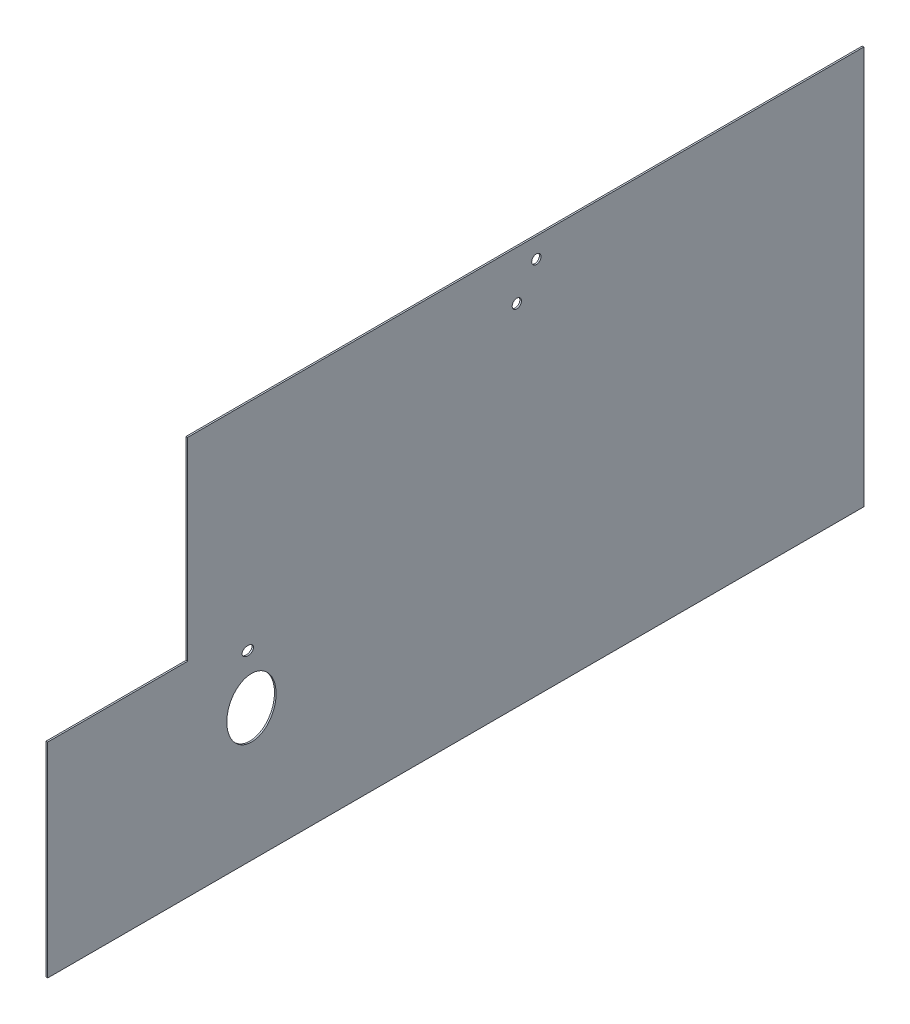
ISO-10303-21;
HEADER;
FILE_DESCRIPTION(('STEP AP214'),'2;1');
FILE_NAME('part.step','',(''),(''),'','','');
FILE_SCHEMA(('AUTOMOTIVE_DESIGN { 1 0 10303 214 1 1 1 1 }'));
ENDSEC;
DATA;
#1=APPLICATION_CONTEXT('core data for automotive mechanical design processes');
#2=APPLICATION_PROTOCOL_DEFINITION('international standard','automotive_design',2000,#1);
#3=PRODUCT_CONTEXT('',#1,'mechanical');
#4=PRODUCT('Part','Part','',(#3));
#5=PRODUCT_RELATED_PRODUCT_CATEGORY('part','',(#4));
#6=PRODUCT_DEFINITION_FORMATION('','',#4);
#7=PRODUCT_DEFINITION_CONTEXT('part definition',#1,'design');
#8=PRODUCT_DEFINITION('design','',#6,#7);
#9=PRODUCT_DEFINITION_SHAPE('','',#8);
#10=(LENGTH_UNIT() NAMED_UNIT(*) SI_UNIT(.MILLI.,.METRE.));
#11=(NAMED_UNIT(*) PLANE_ANGLE_UNIT() SI_UNIT($,.RADIAN.));
#12=(NAMED_UNIT(*) SI_UNIT($,.STERADIAN.) SOLID_ANGLE_UNIT());
#13=UNCERTAINTY_MEASURE_WITH_UNIT(LENGTH_MEASURE(1.E-05),#10,'distance_accuracy_value','');
#14=(GEOMETRIC_REPRESENTATION_CONTEXT(3) GLOBAL_UNCERTAINTY_ASSIGNED_CONTEXT((#13)) GLOBAL_UNIT_ASSIGNED_CONTEXT((#10,
#11,#12)) REPRESENTATION_CONTEXT('',''));
#15=CARTESIAN_POINT('',(0.,0.,0.));
#16=DIRECTION('',(0.,0.,1.));
#17=DIRECTION('',(1.,0.,0.));
#18=AXIS2_PLACEMENT_3D('',#15,#16,#17);
#19=CARTESIAN_POINT('',(-8.,1016.,-696.000061040003));
#20=DIRECTION('',(0.,0.,1.));
#21=DIRECTION('',(0.,-1.,0.));
#22=AXIS2_PLACEMENT_3D('',#19,#20,#21);
#23=PLANE('',#22);
#24=DIRECTION('',(0.,-1.,0.));
#25=VECTOR('',#24,1.);
#26=CARTESIAN_POINT('',(0.,1016.,-696.000061040003));
#27=LINE('',#26,#25);
#28=CARTESIAN_POINT('',(0.,1980.,-696.000061040003));
#29=VERTEX_POINT('',#28);
#30=CARTESIAN_POINT('',(0.,1016.,-696.000061040003));
#31=VERTEX_POINT('',#30);
#32=EDGE_CURVE('E120',#29,#31,#27,.T.);
#33=ORIENTED_EDGE('',*,*,#32,.F.);
#34=DIRECTION('',(1.,0.,0.));
#35=VECTOR('',#34,1.);
#36=CARTESIAN_POINT('',(-8.,1980.,-696.000061040003));
#37=LINE('',#36,#35);
#38=CARTESIAN_POINT('',(-8.,1980.,-696.000061040003));
#39=VERTEX_POINT('',#38);
#40=EDGE_CURVE('E11',#39,#29,#37,.T.);
#41=ORIENTED_EDGE('',*,*,#40,.F.);
#42=DIRECTION('',(0.,-1.,0.));
#43=VECTOR('',#42,1.);
#44=CARTESIAN_POINT('',(-8.,1016.,-696.000061040003));
#45=LINE('',#44,#43);
#46=CARTESIAN_POINT('',(-8.,1016.,-696.000061040003));
#47=VERTEX_POINT('',#46);
#48=EDGE_CURVE('E135',#39,#47,#45,.T.);
#49=ORIENTED_EDGE('',*,*,#48,.T.);
#50=DIRECTION('',(1.,0.,0.));
#51=VECTOR('',#50,1.);
#52=CARTESIAN_POINT('',(-8.,1016.,-696.000061040003));
#53=LINE('',#52,#51);
#54=EDGE_CURVE('E38',#47,#31,#53,.T.);
#55=ORIENTED_EDGE('',*,*,#54,.T.);
#56=EDGE_LOOP('',(#33,#41,#49,#55));
#57=FACE_BOUND('',#56,.T.);
#58=ADVANCED_FACE('F35',(#57),#23,.T.);
#59=CARTESIAN_POINT('',(-8.,1980.,-4058.00036622));
#60=DIRECTION('',(0.,1.,0.));
#61=DIRECTION('',(0.,0.,1.));
#62=AXIS2_PLACEMENT_3D('',#59,#60,#61);
#63=PLANE('',#62);
#64=DIRECTION('',(0.,0.,1.));
#65=VECTOR('',#64,1.);
#66=CARTESIAN_POINT('',(0.,1980.,-4058.00036622));
#67=LINE('',#66,#65);
#68=CARTESIAN_POINT('',(0.,1980.,-4058.00036622));
#69=VERTEX_POINT('',#68);
#70=EDGE_CURVE('E133',#69,#29,#67,.T.);
#71=ORIENTED_EDGE('',*,*,#70,.F.);
#72=DIRECTION('',(1.,0.,0.));
#73=VECTOR('',#72,1.);
#74=CARTESIAN_POINT('',(-8.,1980.,-4058.00036622));
#75=LINE('',#74,#73);
#76=CARTESIAN_POINT('',(-8.,1980.,-4058.00036622));
#77=VERTEX_POINT('',#76);
#78=EDGE_CURVE('E44',#77,#69,#75,.T.);
#79=ORIENTED_EDGE('',*,*,#78,.F.);
#80=DIRECTION('',(0.,0.,1.));
#81=VECTOR('',#80,1.);
#82=CARTESIAN_POINT('',(-8.,1980.,-4058.00036622));
#83=LINE('',#82,#81);
#84=EDGE_CURVE('E110',#77,#39,#83,.T.);
#85=ORIENTED_EDGE('',*,*,#84,.T.);
#86=ORIENTED_EDGE('',*,*,#40,.T.);
#87=EDGE_LOOP('',(#71,#79,#85,#86));
#88=FACE_BOUND('',#87,.T.);
#89=ADVANCED_FACE('F143',(#88),#63,.T.);
#90=CARTESIAN_POINT('',(-8.,0.,-4058.00036622));
#91=DIRECTION('',(0.,0.,-1.));
#92=DIRECTION('',(-1.,0.,0.));
#93=AXIS2_PLACEMENT_3D('',#90,#91,#92);
#94=PLANE('',#93);
#95=DIRECTION('',(0.,1.,0.));
#96=VECTOR('',#95,1.);
#97=CARTESIAN_POINT('',(0.,0.,-4058.00036622));
#98=LINE('',#97,#96);
#99=CARTESIAN_POINT('',(0.,0.,-4058.00036622));
#100=VERTEX_POINT('',#99);
#101=EDGE_CURVE('E97',#100,#69,#98,.T.);
#102=ORIENTED_EDGE('',*,*,#101,.F.);
#103=DIRECTION('',(1.,0.,0.));
#104=VECTOR('',#103,1.);
#105=CARTESIAN_POINT('',(-8.,0.,-4058.00036622));
#106=LINE('',#105,#104);
#107=CARTESIAN_POINT('',(-8.,0.,-4058.00036622));
#108=VERTEX_POINT('',#107);
#109=EDGE_CURVE('E92',#108,#100,#106,.T.);
#110=ORIENTED_EDGE('',*,*,#109,.F.);
#111=DIRECTION('',(0.,1.,0.));
#112=VECTOR('',#111,1.);
#113=CARTESIAN_POINT('',(-8.,0.,-4058.00036622));
#114=LINE('',#113,#112);
#115=EDGE_CURVE('E95',#108,#77,#114,.T.);
#116=ORIENTED_EDGE('',*,*,#115,.T.);
#117=ORIENTED_EDGE('',*,*,#78,.T.);
#118=EDGE_LOOP('',(#102,#110,#116,#117));
#119=FACE_BOUND('',#118,.T.);
#120=ADVANCED_FACE('F94',(#119),#94,.T.);
#121=CARTESIAN_POINT('',(-8.,0.,0.));
#122=DIRECTION('',(0.,-1.,0.));
#123=DIRECTION('',(0.,0.,-1.));
#124=AXIS2_PLACEMENT_3D('',#121,#122,#123);
#125=PLANE('',#124);
#126=DIRECTION('',(0.,0.,-1.));
#127=VECTOR('',#126,1.);
#128=CARTESIAN_POINT('',(0.,0.,0.));
#129=LINE('',#128,#127);
#130=CARTESIAN_POINT('',(0.,0.,0.));
#131=VERTEX_POINT('',#130);
#132=EDGE_CURVE('E130',#131,#100,#129,.T.);
#133=ORIENTED_EDGE('',*,*,#132,.F.);
#134=DIRECTION('',(1.,0.,0.));
#135=VECTOR('',#134,1.);
#136=CARTESIAN_POINT('',(-8.,0.,0.));
#137=LINE('',#136,#135);
#138=CARTESIAN_POINT('',(-8.,0.,0.));
#139=VERTEX_POINT('',#138);
#140=EDGE_CURVE('E102',#139,#131,#137,.T.);
#141=ORIENTED_EDGE('',*,*,#140,.F.);
#142=DIRECTION('',(0.,0.,-1.));
#143=VECTOR('',#142,1.);
#144=CARTESIAN_POINT('',(-8.,0.,0.));
#145=LINE('',#144,#143);
#146=EDGE_CURVE('E108',#139,#108,#145,.T.);
#147=ORIENTED_EDGE('',*,*,#146,.T.);
#148=ORIENTED_EDGE('',*,*,#109,.T.);
#149=EDGE_LOOP('',(#133,#141,#147,#148));
#150=FACE_BOUND('',#149,.T.);
#151=ADVANCED_FACE('F112',(#150),#125,.T.);
#152=CARTESIAN_POINT('',(-8.,1016.,0.));
#153=DIRECTION('',(0.,0.,1.));
#154=DIRECTION('',(1.,0.,0.));
#155=AXIS2_PLACEMENT_3D('',#152,#153,#154);
#156=PLANE('',#155);
#157=DIRECTION('',(0.,-1.,0.));
#158=VECTOR('',#157,1.);
#159=CARTESIAN_POINT('',(0.,1016.,0.));
#160=LINE('',#159,#158);
#161=CARTESIAN_POINT('',(0.,1016.,0.));
#162=VERTEX_POINT('',#161);
#163=EDGE_CURVE('E127',#162,#131,#160,.T.);
#164=ORIENTED_EDGE('',*,*,#163,.F.);
#165=DIRECTION('',(1.,0.,0.));
#166=VECTOR('',#165,1.);
#167=CARTESIAN_POINT('',(-8.,1016.,0.));
#168=LINE('',#167,#166);
#169=CARTESIAN_POINT('',(-8.,1016.,0.));
#170=VERTEX_POINT('',#169);
#171=EDGE_CURVE('E138',#170,#162,#168,.T.);
#172=ORIENTED_EDGE('',*,*,#171,.F.);
#173=DIRECTION('',(0.,-1.,0.));
#174=VECTOR('',#173,1.);
#175=CARTESIAN_POINT('',(-8.,1016.,0.));
#176=LINE('',#175,#174);
#177=EDGE_CURVE('E113',#170,#139,#176,.T.);
#178=ORIENTED_EDGE('',*,*,#177,.T.);
#179=ORIENTED_EDGE('',*,*,#140,.T.);
#180=EDGE_LOOP('',(#164,#172,#178,#179));
#181=FACE_BOUND('',#180,.T.);
#182=ADVANCED_FACE('F156',(#181),#156,.T.);
#183=CARTESIAN_POINT('',(-8.,1016.,-696.000061040003));
#184=DIRECTION('',(0.,1.,0.));
#185=DIRECTION('',(0.,0.,1.));
#186=AXIS2_PLACEMENT_3D('',#183,#184,#185);
#187=PLANE('',#186);
#188=DIRECTION('',(0.,0.,1.));
#189=VECTOR('',#188,1.);
#190=CARTESIAN_POINT('',(0.,1016.,-696.000061040003));
#191=LINE('',#190,#189);
#192=EDGE_CURVE('E123',#31,#162,#191,.T.);
#193=ORIENTED_EDGE('',*,*,#192,.F.);
#194=ORIENTED_EDGE('',*,*,#54,.F.);
#195=DIRECTION('',(0.,0.,1.));
#196=VECTOR('',#195,1.);
#197=CARTESIAN_POINT('',(-8.,1016.,-696.000061040003));
#198=LINE('',#197,#196);
#199=EDGE_CURVE('E115',#47,#170,#198,.T.);
#200=ORIENTED_EDGE('',*,*,#199,.T.);
#201=ORIENTED_EDGE('',*,*,#171,.T.);
#202=EDGE_LOOP('',(#193,#194,#200,#201));
#203=FACE_BOUND('',#202,.T.);
#204=ADVANCED_FACE('F140',(#203),#187,.T.);
#205=CARTESIAN_POINT('',(-8.,1980.,-696.000061040003));
#206=DIRECTION('',(1.,0.,0.));
#207=DIRECTION('',(0.,0.,-1.));
#208=AXIS2_PLACEMENT_3D('',#205,#206,#207);
#209=PLANE('',#208);
#210=CARTESIAN_POINT('',(-8.,1880.,-2429.37500000001));
#211=DIRECTION('',(1.,0.,0.));
#212=DIRECTION('',(0.,0.,-1.));
#213=AXIS2_PLACEMENT_3D('',#210,#211,#212);
#214=CIRCLE('',#213,23.0000000000004);
#215=CARTESIAN_POINT('',(-8.,1880.,-2452.37500000001));
#216=VERTEX_POINT('',#215);
#217=EDGE_CURVE('E200',#216,#216,#214,.T.);
#218=ORIENTED_EDGE('',*,*,#217,.T.);
#219=EDGE_LOOP('',(#218));
#220=FACE_BOUND('',#219,.T.);
#221=CARTESIAN_POINT('',(-8.,1738.,-2332.37500000001));
#222=DIRECTION('',(1.,0.,0.));
#223=DIRECTION('',(0.,0.,-1.));
#224=AXIS2_PLACEMENT_3D('',#221,#222,#223);
#225=CIRCLE('',#224,23.0000000000004);
#226=CARTESIAN_POINT('',(-8.,1738.,-2355.37500000001));
#227=VERTEX_POINT('',#226);
#228=EDGE_CURVE('E194',#227,#227,#225,.T.);
#229=ORIENTED_EDGE('',*,*,#228,.T.);
#230=EDGE_LOOP('',(#229));
#231=FACE_BOUND('',#230,.T.);
#232=CARTESIAN_POINT('',(-8.,912.,-995.000366220003));
#233=DIRECTION('',(1.,0.,0.));
#234=DIRECTION('',(0.,0.,-1.));
#235=AXIS2_PLACEMENT_3D('',#232,#233,#234);
#236=ELLIPSE('',#235,28.4999999999996,22.0000000000002);
#237=CARTESIAN_POINT('',(-8.,912.,-1023.50036622));
#238=VERTEX_POINT('',#237);
#239=EDGE_CURVE('E187',#238,#238,#236,.T.);
#240=ORIENTED_EDGE('',*,*,#239,.T.);
#241=EDGE_LOOP('',(#240));
#242=FACE_BOUND('',#241,.T.);
#243=CARTESIAN_POINT('',(-8.,657.,-1013.00036622));
#244=DIRECTION('',(1.,0.,0.));
#245=DIRECTION('',(0.,-1.,0.));
#246=AXIS2_PLACEMENT_3D('',#243,#244,#245);
#247=ELLIPSE('',#246,147.5,122.5);
#248=CARTESIAN_POINT('',(-8.,509.5,-1013.00036622));
#249=VERTEX_POINT('',#248);
#250=EDGE_CURVE('E124',#249,#249,#247,.T.);
#251=ORIENTED_EDGE('',*,*,#250,.T.);
#252=EDGE_LOOP('',(#251));
#253=FACE_BOUND('',#252,.T.);
#254=ORIENTED_EDGE('',*,*,#48,.F.);
#255=ORIENTED_EDGE('',*,*,#84,.F.);
#256=ORIENTED_EDGE('',*,*,#115,.F.);
#257=ORIENTED_EDGE('',*,*,#146,.F.);
#258=ORIENTED_EDGE('',*,*,#177,.F.);
#259=ORIENTED_EDGE('',*,*,#199,.F.);
#260=EDGE_LOOP('',(#254,#255,#256,#257,#258,#259));
#261=FACE_BOUND('',#260,.T.);
#262=ADVANCED_FACE('F106',(#220,#231,#242,#253,#261),#209,.F.);
#263=CARTESIAN_POINT('',(0.,1980.,-696.000061040003));
#264=DIRECTION('',(1.,0.,0.));
#265=DIRECTION('',(0.,0.,-1.));
#266=AXIS2_PLACEMENT_3D('',#263,#264,#265);
#267=PLANE('',#266);
#268=CARTESIAN_POINT('',(0.,1880.,-2429.37500000001));
#269=DIRECTION('',(1.,0.,0.));
#270=DIRECTION('',(0.,0.,-1.));
#271=AXIS2_PLACEMENT_3D('',#268,#269,#270);
#272=CIRCLE('',#271,23.0000000000004);
#273=CARTESIAN_POINT('',(0.,1880.,-2452.37500000001));
#274=VERTEX_POINT('',#273);
#275=EDGE_CURVE('E203',#274,#274,#272,.T.);
#276=ORIENTED_EDGE('',*,*,#275,.F.);
#277=EDGE_LOOP('',(#276));
#278=FACE_BOUND('',#277,.T.);
#279=CARTESIAN_POINT('',(0.,1738.,-2332.37500000001));
#280=DIRECTION('',(1.,0.,0.));
#281=DIRECTION('',(0.,0.,-1.));
#282=AXIS2_PLACEMENT_3D('',#279,#280,#281);
#283=CIRCLE('',#282,23.0000000000004);
#284=CARTESIAN_POINT('',(0.,1738.,-2355.37500000001));
#285=VERTEX_POINT('',#284);
#286=EDGE_CURVE('E197',#285,#285,#283,.T.);
#287=ORIENTED_EDGE('',*,*,#286,.F.);
#288=EDGE_LOOP('',(#287));
#289=FACE_BOUND('',#288,.T.);
#290=CARTESIAN_POINT('',(0.,912.,-995.000366220003));
#291=DIRECTION('',(1.,0.,0.));
#292=DIRECTION('',(0.,0.,-1.));
#293=AXIS2_PLACEMENT_3D('',#290,#291,#292);
#294=ELLIPSE('',#293,28.4999999999996,22.0000000000002);
#295=CARTESIAN_POINT('',(0.,912.,-1023.50036622));
#296=VERTEX_POINT('',#295);
#297=EDGE_CURVE('E184',#296,#296,#294,.T.);
#298=ORIENTED_EDGE('',*,*,#297,.F.);
#299=EDGE_LOOP('',(#298));
#300=FACE_BOUND('',#299,.T.);
#301=CARTESIAN_POINT('',(0.,657.,-1013.00036622));
#302=DIRECTION('',(1.,0.,0.));
#303=DIRECTION('',(0.,-1.,0.));
#304=AXIS2_PLACEMENT_3D('',#301,#302,#303);
#305=ELLIPSE('',#304,147.5,122.5);
#306=CARTESIAN_POINT('',(0.,509.5,-1013.00036622));
#307=VERTEX_POINT('',#306);
#308=EDGE_CURVE('E183',#307,#307,#305,.T.);
#309=ORIENTED_EDGE('',*,*,#308,.F.);
#310=EDGE_LOOP('',(#309));
#311=FACE_BOUND('',#310,.T.);
#312=ORIENTED_EDGE('',*,*,#32,.T.);
#313=ORIENTED_EDGE('',*,*,#192,.T.);
#314=ORIENTED_EDGE('',*,*,#163,.T.);
#315=ORIENTED_EDGE('',*,*,#132,.T.);
#316=ORIENTED_EDGE('',*,*,#101,.T.);
#317=ORIENTED_EDGE('',*,*,#70,.T.);
#318=EDGE_LOOP('',(#312,#313,#314,#315,#316,#317));
#319=FACE_BOUND('',#318,.T.);
#320=ADVANCED_FACE('F142',(#278,#289,#300,#311,#319),#267,.T.);
#321=DIRECTION('',(1.,0.,0.));
#322=VECTOR('',#321,1.);
#323=SURFACE_OF_LINEAR_EXTRUSION('',#247,#322);
#324=ORIENTED_EDGE('',*,*,#250,.F.);
#325=EDGE_LOOP('',(#324));
#326=FACE_BOUND('',#325,.T.);
#327=ORIENTED_EDGE('',*,*,#308,.T.);
#328=EDGE_LOOP('',(#327));
#329=FACE_BOUND('',#328,.T.);
#330=ADVANCED_FACE('F167',(#326,#329),#323,.F.);
#331=DIRECTION('',(1.,0.,0.));
#332=VECTOR('',#331,1.);
#333=SURFACE_OF_LINEAR_EXTRUSION('',#236,#332);
#334=ORIENTED_EDGE('',*,*,#239,.F.);
#335=EDGE_LOOP('',(#334));
#336=FACE_BOUND('',#335,.T.);
#337=ORIENTED_EDGE('',*,*,#297,.T.);
#338=EDGE_LOOP('',(#337));
#339=FACE_BOUND('',#338,.T.);
#340=ADVANCED_FACE('F175',(#336,#339),#333,.F.);
#341=CARTESIAN_POINT('',(-8.,1738.,-2332.37500000001));
#342=DIRECTION('',(1.,0.,0.));
#343=DIRECTION('',(0.,0.,-1.));
#344=AXIS2_PLACEMENT_3D('',#341,#342,#343);
#345=CYLINDRICAL_SURFACE('',#344,23.0000000000004);
#346=ORIENTED_EDGE('',*,*,#228,.F.);
#347=EDGE_LOOP('',(#346));
#348=FACE_BOUND('',#347,.T.);
#349=ORIENTED_EDGE('',*,*,#286,.T.);
#350=EDGE_LOOP('',(#349));
#351=FACE_BOUND('',#350,.T.);
#352=ADVANCED_FACE('F211',(#348,#351),#345,.F.);
#353=CARTESIAN_POINT('',(-8.,1880.,-2429.37500000001));
#354=DIRECTION('',(1.,0.,0.));
#355=DIRECTION('',(0.,0.,-1.));
#356=AXIS2_PLACEMENT_3D('',#353,#354,#355);
#357=CYLINDRICAL_SURFACE('',#356,23.0000000000004);
#358=ORIENTED_EDGE('',*,*,#217,.F.);
#359=EDGE_LOOP('',(#358));
#360=FACE_BOUND('',#359,.T.);
#361=ORIENTED_EDGE('',*,*,#275,.T.);
#362=EDGE_LOOP('',(#361));
#363=FACE_BOUND('',#362,.T.);
#364=ADVANCED_FACE('F208',(#360,#363),#357,.F.);
#365=CLOSED_SHELL('',(#58,#89,#120,#151,#182,#204,#262,#320,#330,#340,#352,#364));
#366=MANIFOLD_SOLID_BREP('B2',#365);
#367=ADVANCED_BREP_SHAPE_REPRESENTATION('',(#18,#366),#14);
#368=SHAPE_DEFINITION_REPRESENTATION(#9,#367);
ENDSEC;
END-ISO-10303-21;
